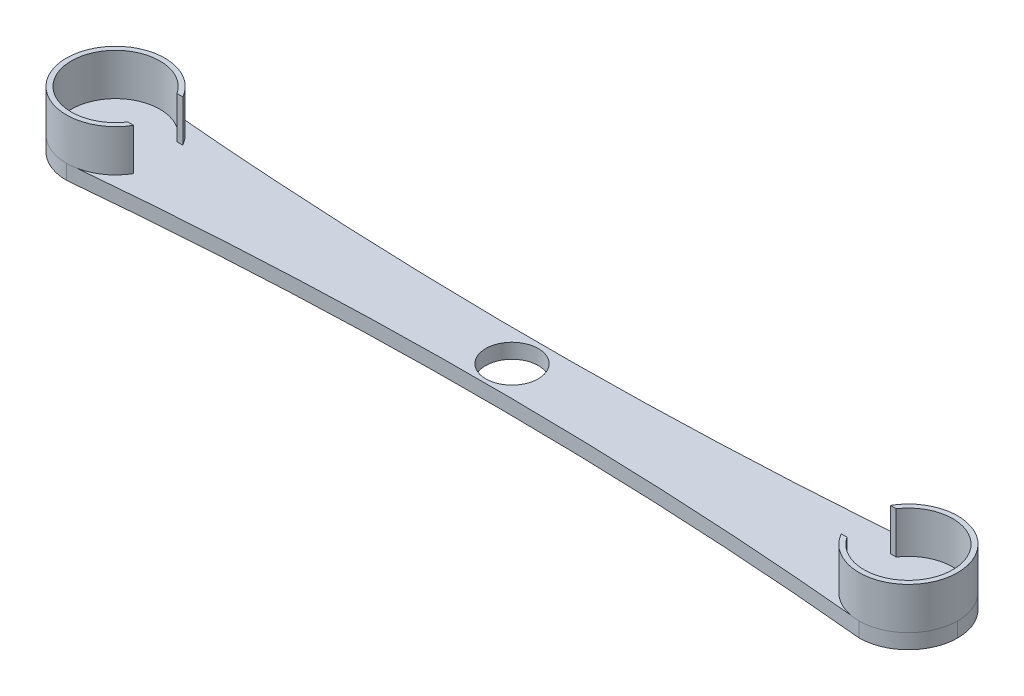
ISO-10303-21;
HEADER;
FILE_DESCRIPTION(('STEP AP214'),'2;1');
FILE_NAME('part.step','',(''),(''),'','','');
FILE_SCHEMA(('AUTOMOTIVE_DESIGN { 1 0 10303 214 1 1 1 1 }'));
ENDSEC;
DATA;
#1=APPLICATION_CONTEXT('core data for automotive mechanical design processes');
#2=APPLICATION_PROTOCOL_DEFINITION('international standard','automotive_design',2000,#1);
#3=PRODUCT_CONTEXT('',#1,'mechanical');
#4=PRODUCT('Part','Part','',(#3));
#5=PRODUCT_RELATED_PRODUCT_CATEGORY('part','',(#4));
#6=PRODUCT_DEFINITION_FORMATION('','',#4);
#7=PRODUCT_DEFINITION_CONTEXT('part definition',#1,'design');
#8=PRODUCT_DEFINITION('design','',#6,#7);
#9=PRODUCT_DEFINITION_SHAPE('','',#8);
#10=(LENGTH_UNIT() NAMED_UNIT(*) SI_UNIT(.MILLI.,.METRE.));
#11=(NAMED_UNIT(*) PLANE_ANGLE_UNIT() SI_UNIT($,.RADIAN.));
#12=(NAMED_UNIT(*) SI_UNIT($,.STERADIAN.) SOLID_ANGLE_UNIT());
#13=UNCERTAINTY_MEASURE_WITH_UNIT(LENGTH_MEASURE(1.E-05),#10,'distance_accuracy_value','');
#14=(GEOMETRIC_REPRESENTATION_CONTEXT(3) GLOBAL_UNCERTAINTY_ASSIGNED_CONTEXT((#13)) GLOBAL_UNIT_ASSIGNED_CONTEXT((#10,
#11,#12)) REPRESENTATION_CONTEXT('',''));
#15=CARTESIAN_POINT('',(0.,0.,0.));
#16=DIRECTION('',(0.,0.,1.));
#17=DIRECTION('',(1.,0.,0.));
#18=AXIS2_PLACEMENT_3D('',#15,#16,#17);
#19=CARTESIAN_POINT('',(0.,3.,-6.375));
#20=DIRECTION('',(0.,-1.,0.));
#21=DIRECTION('',(0.,0.,-1.));
#22=AXIS2_PLACEMENT_3D('',#19,#20,#21);
#23=PLANE('',#22);
#24=CARTESIAN_POINT('',(0.,3.,0.));
#25=DIRECTION('',(0.,1.,0.));
#26=DIRECTION('',(0.,0.,1.));
#27=AXIS2_PLACEMENT_3D('',#24,#25,#26);
#28=CIRCLE('',#27,5.33449361263792);
#29=CARTESIAN_POINT('',(0.,3.,5.33449361263793));
#30=VERTEX_POINT('',#29);
#31=EDGE_CURVE('E228',#30,#30,#28,.T.);
#32=ORIENTED_EDGE('',*,*,#31,.F.);
#33=EDGE_LOOP('',(#32));
#34=FACE_BOUND('',#33,.T.);
#35=CARTESIAN_POINT('',(80.5,3.,0.));
#36=DIRECTION('',(0.,1.,0.));
#37=DIRECTION('',(0.,0.,1.));
#38=AXIS2_PLACEMENT_3D('',#35,#36,#37);
#39=CIRCLE('',#38,10.);
#40=CARTESIAN_POINT('',(71.8397459621556,3.,5.));
#41=VERTEX_POINT('',#40);
#42=CARTESIAN_POINT('',(78.6177020654805,3.,9.82125014882035));
#43=VERTEX_POINT('',#42);
#44=EDGE_CURVE('E394',#41,#43,#39,.T.);
#45=ORIENTED_EDGE('',*,*,#44,.F.);
#46=DIRECTION('',(-1.,0.,0.));
#47=VECTOR('',#46,1.);
#48=CARTESIAN_POINT('',(71.8397459621556,3.,5.));
#49=LINE('',#48,#47);
#50=CARTESIAN_POINT('',(73.0166852264521,3.,5.));
#51=VERTEX_POINT('',#50);
#52=EDGE_CURVE('E400',#51,#41,#49,.T.);
#53=ORIENTED_EDGE('',*,*,#52,.F.);
#54=CARTESIAN_POINT('',(80.5,3.,0.));
#55=DIRECTION('',(0.,-1.,0.));
#56=DIRECTION('',(0.,0.,1.));
#57=AXIS2_PLACEMENT_3D('',#54,#55,#56);
#58=CIRCLE('',#57,9.);
#59=CARTESIAN_POINT('',(73.0166852264521,3.,-5.));
#60=VERTEX_POINT('',#59);
#61=EDGE_CURVE('E188',#60,#51,#58,.T.);
#62=ORIENTED_EDGE('',*,*,#61,.F.);
#63=DIRECTION('',(1.,0.,0.));
#64=VECTOR('',#63,1.);
#65=CARTESIAN_POINT('',(71.8397459621556,3.,-5.));
#66=LINE('',#65,#64);
#67=CARTESIAN_POINT('',(71.8397459621556,3.,-5.));
#68=VERTEX_POINT('',#67);
#69=EDGE_CURVE('E167',#68,#60,#66,.T.);
#70=ORIENTED_EDGE('',*,*,#69,.F.);
#71=CARTESIAN_POINT('',(78.7325547002867,3.,-9.84256760771913));
#72=VERTEX_POINT('',#71);
#73=EDGE_CURVE('E177',#72,#68,#39,.T.);
#74=ORIENTED_EDGE('',*,*,#73,.F.);
#75=CARTESIAN_POINT('',(80.5000000000003,3.,-10.));
#76=CARTESIAN_POINT('',(0.,3.,-2.75));
#77=CARTESIAN_POINT('',(-80.5000000000002,3.,-10.));
#78=B_SPLINE_CURVE_WITH_KNOTS('',2,(#75,#76,#77),.UNSPECIFIED.,.F.,.F.,(3,3),(0.,1.),.UNSPECIFIED.);
#79=CARTESIAN_POINT('',(-78.7325547002872,3.,-9.84256760771916));
#80=VERTEX_POINT('',#79);
#81=EDGE_CURVE('E405',#72,#80,#78,.T.);
#82=ORIENTED_EDGE('',*,*,#81,.T.);
#83=CARTESIAN_POINT('',(-80.5000000000002,3.,0.));
#84=DIRECTION('',(0.,1.,0.));
#85=DIRECTION('',(0.,0.,1.));
#86=AXIS2_PLACEMENT_3D('',#83,#84,#85);
#87=CIRCLE('',#86,10.);
#88=CARTESIAN_POINT('',(-71.8397459621558,3.,-5.));
#89=VERTEX_POINT('',#88);
#90=EDGE_CURVE('E203',#89,#80,#87,.T.);
#91=ORIENTED_EDGE('',*,*,#90,.F.);
#92=DIRECTION('',(1.,0.,0.));
#93=VECTOR('',#92,1.);
#94=CARTESIAN_POINT('',(-73.0166852264523,3.,-5.));
#95=LINE('',#94,#93);
#96=CARTESIAN_POINT('',(-73.0166852264523,3.,-4.99999999999999));
#97=VERTEX_POINT('',#96);
#98=EDGE_CURVE('E196',#97,#89,#95,.T.);
#99=ORIENTED_EDGE('',*,*,#98,.F.);
#100=CARTESIAN_POINT('',(-80.5000000000002,3.,0.));
#101=DIRECTION('',(0.,-1.,0.));
#102=DIRECTION('',(0.,0.,1.));
#103=AXIS2_PLACEMENT_3D('',#100,#101,#102);
#104=CIRCLE('',#103,8.99999999999999);
#105=CARTESIAN_POINT('',(-73.0166852264524,3.,5.));
#106=VERTEX_POINT('',#105);
#107=EDGE_CURVE('E211',#106,#97,#104,.T.);
#108=ORIENTED_EDGE('',*,*,#107,.F.);
#109=DIRECTION('',(-1.,0.,0.));
#110=VECTOR('',#109,1.);
#111=CARTESIAN_POINT('',(-73.0166852264524,3.,5.));
#112=LINE('',#111,#110);
#113=CARTESIAN_POINT('',(-71.8397459621558,3.,5.));
#114=VERTEX_POINT('',#113);
#115=EDGE_CURVE('E206',#114,#106,#112,.T.);
#116=ORIENTED_EDGE('',*,*,#115,.F.);
#117=CARTESIAN_POINT('',(-78.6177020654812,3.,9.82125014882043));
#118=VERTEX_POINT('',#117);
#119=EDGE_CURVE('E208',#118,#114,#87,.T.);
#120=ORIENTED_EDGE('',*,*,#119,.F.);
#121=CARTESIAN_POINT('',(-80.5000000000002,3.,10.));
#122=CARTESIAN_POINT('',(0.,3.,2.26499530901749));
#123=CARTESIAN_POINT('',(80.5000000000003,3.,10.));
#124=B_SPLINE_CURVE_WITH_KNOTS('',2,(#121,#122,#123),.UNSPECIFIED.,.F.,.F.,(3,3),(0.,1.),.UNSPECIFIED.);
#125=EDGE_CURVE('E241',#118,#43,#124,.T.);
#126=ORIENTED_EDGE('',*,*,#125,.T.);
#127=EDGE_LOOP('',(#45,#53,#62,#70,#74,#82,#91,#99,#108,#116,#120,#126));
#128=FACE_BOUND('',#127,.T.);
#129=ADVANCED_FACE('F39',(#34,#128),#23,.F.);
#130=CARTESIAN_POINT('',(0.,0.,-6.375));
#131=DIRECTION('',(0.,-1.,0.));
#132=DIRECTION('',(0.,0.,-1.));
#133=AXIS2_PLACEMENT_3D('',#130,#131,#132);
#134=PLANE('',#133);
#135=CARTESIAN_POINT('',(-80.5000000000002,0.,10.));
#136=CARTESIAN_POINT('',(0.,0.,2.26499530901749));
#137=CARTESIAN_POINT('',(80.5000000000003,0.,10.));
#138=B_SPLINE_CURVE_WITH_KNOTS('',2,(#135,#136,#137),.UNSPECIFIED.,.F.,.F.,(3,3),(0.,1.),.UNSPECIFIED.);
#139=CARTESIAN_POINT('',(-80.5000000000002,0.,10.));
#140=VERTEX_POINT('',#139);
#141=CARTESIAN_POINT('',(80.5000000000003,0.,10.));
#142=VERTEX_POINT('',#141);
#143=EDGE_CURVE('E231',#140,#142,#138,.T.);
#144=ORIENTED_EDGE('',*,*,#143,.F.);
#145=CARTESIAN_POINT('',(-80.5000000000002,0.,0.));
#146=DIRECTION('',(0.,-1.,0.));
#147=DIRECTION('',(0.,0.,-1.));
#148=AXIS2_PLACEMENT_3D('',#145,#146,#147);
#149=CIRCLE('',#148,10.);
#150=CARTESIAN_POINT('',(-90.5000000000002,0.,0.));
#151=VERTEX_POINT('',#150);
#152=EDGE_CURVE('E11',#140,#151,#149,.T.);
#153=ORIENTED_EDGE('',*,*,#152,.T.);
#154=CARTESIAN_POINT('',(-80.5000000000002,0.,0.));
#155=DIRECTION('',(0.,-1.,0.));
#156=DIRECTION('',(0.,0.,-1.));
#157=AXIS2_PLACEMENT_3D('',#154,#155,#156);
#158=CIRCLE('',#157,10.);
#159=CARTESIAN_POINT('',(-80.5000000000002,0.,-10.));
#160=VERTEX_POINT('',#159);
#161=EDGE_CURVE('E48',#151,#160,#158,.T.);
#162=ORIENTED_EDGE('',*,*,#161,.T.);
#163=CARTESIAN_POINT('',(80.5000000000003,0.,-10.));
#164=CARTESIAN_POINT('',(0.,0.,-2.75));
#165=CARTESIAN_POINT('',(-80.5000000000002,0.,-10.));
#166=B_SPLINE_CURVE_WITH_KNOTS('',2,(#163,#164,#165),.UNSPECIFIED.,.F.,.F.,(3,3),(0.,1.),.UNSPECIFIED.);
#167=CARTESIAN_POINT('',(80.5000000000003,0.,-10.));
#168=VERTEX_POINT('',#167);
#169=EDGE_CURVE('E380',#168,#160,#166,.T.);
#170=ORIENTED_EDGE('',*,*,#169,.F.);
#171=CARTESIAN_POINT('',(80.5,0.,0.));
#172=DIRECTION('',(0.,-1.,0.));
#173=DIRECTION('',(0.,0.,-1.));
#174=AXIS2_PLACEMENT_3D('',#171,#172,#173);
#175=CIRCLE('',#174,10.);
#176=CARTESIAN_POINT('',(90.5,0.,0.));
#177=VERTEX_POINT('',#176);
#178=EDGE_CURVE('E61',#168,#177,#175,.T.);
#179=ORIENTED_EDGE('',*,*,#178,.T.);
#180=CARTESIAN_POINT('',(80.5,0.,0.));
#181=DIRECTION('',(0.,-1.,0.));
#182=DIRECTION('',(0.,0.,-1.));
#183=AXIS2_PLACEMENT_3D('',#180,#181,#182);
#184=CIRCLE('',#183,10.);
#185=EDGE_CURVE('E367',#177,#142,#184,.T.);
#186=ORIENTED_EDGE('',*,*,#185,.T.);
#187=EDGE_LOOP('',(#144,#153,#162,#170,#179,#186));
#188=FACE_BOUND('',#187,.T.);
#189=CARTESIAN_POINT('',(0.,0.,0.));
#190=DIRECTION('',(0.,1.,0.));
#191=DIRECTION('',(0.,0.,1.));
#192=AXIS2_PLACEMENT_3D('',#189,#190,#191);
#193=CIRCLE('',#192,5.33449361263792);
#194=CARTESIAN_POINT('',(0.,0.,5.33449361263793));
#195=VERTEX_POINT('',#194);
#196=EDGE_CURVE('E227',#195,#195,#193,.T.);
#197=ORIENTED_EDGE('',*,*,#196,.T.);
#198=EDGE_LOOP('',(#197));
#199=FACE_BOUND('',#198,.T.);
#200=ADVANCED_FACE('F256',(#188,#199),#134,.T.);
#201=DIRECTION('',(0.,-1.,0.));
#202=VECTOR('',#201,1.);
#203=SURFACE_OF_LINEAR_EXTRUSION('',#124,#202);
#204=ORIENTED_EDGE('',*,*,#143,.T.);
#205=DIRECTION('',(0.,-1.,0.));
#206=VECTOR('',#205,1.);
#207=CARTESIAN_POINT('',(80.5000000000003,3.,10.));
#208=LINE('',#207,#206);
#209=CARTESIAN_POINT('',(80.5000000000003,3.,10.));
#210=VERTEX_POINT('',#209);
#211=EDGE_CURVE('E355',#210,#142,#208,.T.);
#212=ORIENTED_EDGE('',*,*,#211,.F.);
#213=CARTESIAN_POINT('',(-80.5000000000002,3.,10.));
#214=CARTESIAN_POINT('',(0.,3.,2.26499530901749));
#215=CARTESIAN_POINT('',(80.5000000000003,3.,10.));
#216=B_SPLINE_CURVE_WITH_KNOTS('',2,(#213,#214,#215),.UNSPECIFIED.,.F.,.F.,(3,3),(0.,1.),.UNSPECIFIED.);
#217=EDGE_CURVE('E182',#43,#210,#216,.T.);
#218=ORIENTED_EDGE('',*,*,#217,.F.);
#219=ORIENTED_EDGE('',*,*,#125,.F.);
#220=CARTESIAN_POINT('',(-80.5000000000002,3.,10.));
#221=VERTEX_POINT('',#220);
#222=EDGE_CURVE('E234',#221,#118,#124,.T.);
#223=ORIENTED_EDGE('',*,*,#222,.F.);
#224=DIRECTION('',(0.,-1.,0.));
#225=VECTOR('',#224,1.);
#226=CARTESIAN_POINT('',(-80.5000000000002,3.,10.));
#227=LINE('',#226,#225);
#228=EDGE_CURVE('E359',#221,#140,#227,.T.);
#229=ORIENTED_EDGE('',*,*,#228,.T.);
#230=EDGE_LOOP('',(#204,#212,#218,#219,#223,#229));
#231=FACE_BOUND('',#230,.T.);
#232=ADVANCED_FACE('F251',(#231),#203,.F.);
#233=DIRECTION('',(0.,-1.,0.));
#234=VECTOR('',#233,1.);
#235=SURFACE_OF_LINEAR_EXTRUSION('',#78,#234);
#236=ORIENTED_EDGE('',*,*,#169,.T.);
#237=DIRECTION('',(0.,-1.,0.));
#238=VECTOR('',#237,1.);
#239=CARTESIAN_POINT('',(-80.5000000000002,3.,-10.));
#240=LINE('',#239,#238);
#241=CARTESIAN_POINT('',(-80.5000000000002,3.,-10.));
#242=VERTEX_POINT('',#241);
#243=EDGE_CURVE('E356',#242,#160,#240,.T.);
#244=ORIENTED_EDGE('',*,*,#243,.F.);
#245=EDGE_CURVE('E240',#80,#242,#78,.T.);
#246=ORIENTED_EDGE('',*,*,#245,.F.);
#247=ORIENTED_EDGE('',*,*,#81,.F.);
#248=CARTESIAN_POINT('',(80.5000000000003,3.,-10.));
#249=VERTEX_POINT('',#248);
#250=EDGE_CURVE('E242',#249,#72,#78,.T.);
#251=ORIENTED_EDGE('',*,*,#250,.F.);
#252=DIRECTION('',(0.,-1.,0.));
#253=VECTOR('',#252,1.);
#254=CARTESIAN_POINT('',(80.5000000000003,3.,-10.));
#255=LINE('',#254,#253);
#256=EDGE_CURVE('E352',#249,#168,#255,.T.);
#257=ORIENTED_EDGE('',*,*,#256,.T.);
#258=EDGE_LOOP('',(#236,#244,#246,#247,#251,#257));
#259=FACE_BOUND('',#258,.T.);
#260=ADVANCED_FACE('F255',(#259),#235,.F.);
#261=CARTESIAN_POINT('',(0.,3.,0.));
#262=DIRECTION('',(0.,-1.,0.));
#263=DIRECTION('',(0.,0.,-1.));
#264=AXIS2_PLACEMENT_3D('',#261,#262,#263);
#265=CYLINDRICAL_SURFACE('',#264,5.33449361263792);
#266=ORIENTED_EDGE('',*,*,#31,.T.);
#267=EDGE_LOOP('',(#266));
#268=FACE_BOUND('',#267,.T.);
#269=ORIENTED_EDGE('',*,*,#196,.F.);
#270=EDGE_LOOP('',(#269));
#271=FACE_BOUND('',#270,.T.);
#272=ADVANCED_FACE('F283',(#268,#271),#265,.F.);
#273=CARTESIAN_POINT('',(-80.5000000000002,3.,0.));
#274=DIRECTION('',(0.,1.,0.));
#275=DIRECTION('',(0.,0.,1.));
#276=AXIS2_PLACEMENT_3D('',#273,#274,#275);
#277=PLANE('',#276);
#278=EDGE_CURVE('E187',#221,#118,#87,.T.);
#279=ORIENTED_EDGE('',*,*,#278,.F.);
#280=ORIENTED_EDGE('',*,*,#222,.T.);
#281=EDGE_LOOP('',(#279,#280));
#282=FACE_BOUND('',#281,.T.);
#283=ADVANCED_FACE('F286',(#282),#277,.F.);
#284=EDGE_CURVE('E207',#80,#242,#87,.T.);
#285=ORIENTED_EDGE('',*,*,#284,.F.);
#286=ORIENTED_EDGE('',*,*,#245,.T.);
#287=EDGE_LOOP('',(#285,#286));
#288=FACE_BOUND('',#287,.T.);
#289=ADVANCED_FACE('F292',(#288),#277,.F.);
#290=CARTESIAN_POINT('',(-80.5000000000002,11.5,0.));
#291=DIRECTION('',(0.,-1.,0.));
#292=DIRECTION('',(0.,0.,-1.));
#293=AXIS2_PLACEMENT_3D('',#290,#291,#292);
#294=CYLINDRICAL_SURFACE('',#293,10.);
#295=ORIENTED_EDGE('',*,*,#90,.T.);
#296=ORIENTED_EDGE('',*,*,#284,.T.);
#297=CARTESIAN_POINT('',(-90.5000000000002,3.,0.));
#298=VERTEX_POINT('',#297);
#299=EDGE_CURVE('E369',#242,#298,#87,.T.);
#300=ORIENTED_EDGE('',*,*,#299,.T.);
#301=EDGE_CURVE('E423',#298,#221,#87,.T.);
#302=ORIENTED_EDGE('',*,*,#301,.T.);
#303=ORIENTED_EDGE('',*,*,#278,.T.);
#304=ORIENTED_EDGE('',*,*,#119,.T.);
#305=DIRECTION('',(0.,-1.,0.));
#306=VECTOR('',#305,1.);
#307=CARTESIAN_POINT('',(-71.8397459621558,11.5,5.));
#308=LINE('',#307,#306);
#309=CARTESIAN_POINT('',(-71.8397459621558,11.5,5.));
#310=VERTEX_POINT('',#309);
#311=EDGE_CURVE('E224',#310,#114,#308,.T.);
#312=ORIENTED_EDGE('',*,*,#311,.F.);
#313=CARTESIAN_POINT('',(-80.5000000000002,11.5,0.));
#314=DIRECTION('',(0.,1.,0.));
#315=DIRECTION('',(0.,0.,1.));
#316=AXIS2_PLACEMENT_3D('',#313,#314,#315);
#317=CIRCLE('',#316,10.);
#318=CARTESIAN_POINT('',(-71.8397459621558,11.5,-5.));
#319=VERTEX_POINT('',#318);
#320=EDGE_CURVE('E189',#319,#310,#317,.T.);
#321=ORIENTED_EDGE('',*,*,#320,.F.);
#322=DIRECTION('',(0.,-1.,0.));
#323=VECTOR('',#322,1.);
#324=CARTESIAN_POINT('',(-71.8397459621558,11.5,-5.));
#325=LINE('',#324,#323);
#326=EDGE_CURVE('E202',#319,#89,#325,.T.);
#327=ORIENTED_EDGE('',*,*,#326,.T.);
#328=EDGE_LOOP('',(#295,#296,#300,#302,#303,#304,#312,#321,#327));
#329=FACE_BOUND('',#328,.T.);
#330=ADVANCED_FACE('F288',(#329),#294,.T.);
#331=CARTESIAN_POINT('',(-73.0166852264524,11.5,5.));
#332=DIRECTION('',(0.,0.,1.));
#333=DIRECTION('',(1.,0.,0.));
#334=AXIS2_PLACEMENT_3D('',#331,#332,#333);
#335=PLANE('',#334);
#336=ORIENTED_EDGE('',*,*,#115,.T.);
#337=DIRECTION('',(0.,-1.,0.));
#338=VECTOR('',#337,1.);
#339=CARTESIAN_POINT('',(-73.0166852264524,11.5,5.));
#340=LINE('',#339,#338);
#341=CARTESIAN_POINT('',(-73.0166852264524,11.5,5.));
#342=VERTEX_POINT('',#341);
#343=EDGE_CURVE('E221',#342,#106,#340,.T.);
#344=ORIENTED_EDGE('',*,*,#343,.F.);
#345=DIRECTION('',(-1.,0.,0.));
#346=VECTOR('',#345,1.);
#347=CARTESIAN_POINT('',(-73.0166852264524,11.5,5.));
#348=LINE('',#347,#346);
#349=EDGE_CURVE('E195',#310,#342,#348,.T.);
#350=ORIENTED_EDGE('',*,*,#349,.F.);
#351=ORIENTED_EDGE('',*,*,#311,.T.);
#352=EDGE_LOOP('',(#336,#344,#350,#351));
#353=FACE_BOUND('',#352,.T.);
#354=ADVANCED_FACE('F291',(#353),#335,.F.);
#355=CARTESIAN_POINT('',(-80.5000000000002,11.5,0.));
#356=DIRECTION('',(0.,-1.,0.));
#357=DIRECTION('',(0.,0.,-1.));
#358=AXIS2_PLACEMENT_3D('',#355,#356,#357);
#359=CYLINDRICAL_SURFACE('',#358,8.99999999999999);
#360=ORIENTED_EDGE('',*,*,#107,.T.);
#361=DIRECTION('',(0.,-1.,0.));
#362=VECTOR('',#361,1.);
#363=CARTESIAN_POINT('',(-73.0166852264523,11.5,-4.99999999999999));
#364=LINE('',#363,#362);
#365=CARTESIAN_POINT('',(-73.0166852264523,11.5,-4.99999999999999));
#366=VERTEX_POINT('',#365);
#367=EDGE_CURVE('E218',#366,#97,#364,.T.);
#368=ORIENTED_EDGE('',*,*,#367,.F.);
#369=CARTESIAN_POINT('',(-80.5000000000002,11.5,0.));
#370=DIRECTION('',(0.,-1.,0.));
#371=DIRECTION('',(0.,0.,1.));
#372=AXIS2_PLACEMENT_3D('',#369,#370,#371);
#373=CIRCLE('',#372,8.99999999999999);
#374=EDGE_CURVE('E198',#342,#366,#373,.T.);
#375=ORIENTED_EDGE('',*,*,#374,.F.);
#376=ORIENTED_EDGE('',*,*,#343,.T.);
#377=EDGE_LOOP('',(#360,#368,#375,#376));
#378=FACE_BOUND('',#377,.T.);
#379=ADVANCED_FACE('F296',(#378),#359,.F.);
#380=CARTESIAN_POINT('',(-73.0166852264523,11.5,-5.));
#381=DIRECTION('',(0.,0.,-1.));
#382=DIRECTION('',(-1.,0.,0.));
#383=AXIS2_PLACEMENT_3D('',#380,#381,#382);
#384=PLANE('',#383);
#385=ORIENTED_EDGE('',*,*,#98,.T.);
#386=ORIENTED_EDGE('',*,*,#326,.F.);
#387=DIRECTION('',(1.,0.,0.));
#388=VECTOR('',#387,1.);
#389=CARTESIAN_POINT('',(-73.0166852264523,11.5,-5.));
#390=LINE('',#389,#388);
#391=EDGE_CURVE('E200',#366,#319,#390,.T.);
#392=ORIENTED_EDGE('',*,*,#391,.F.);
#393=ORIENTED_EDGE('',*,*,#367,.T.);
#394=EDGE_LOOP('',(#385,#386,#392,#393));
#395=FACE_BOUND('',#394,.T.);
#396=ADVANCED_FACE('F300',(#395),#384,.F.);
#397=CARTESIAN_POINT('',(-80.5000000000002,11.5,0.));
#398=DIRECTION('',(0.,1.,0.));
#399=DIRECTION('',(0.,0.,1.));
#400=AXIS2_PLACEMENT_3D('',#397,#398,#399);
#401=PLANE('',#400);
#402=ORIENTED_EDGE('',*,*,#320,.T.);
#403=ORIENTED_EDGE('',*,*,#349,.T.);
#404=ORIENTED_EDGE('',*,*,#374,.T.);
#405=ORIENTED_EDGE('',*,*,#391,.T.);
#406=EDGE_LOOP('',(#402,#403,#404,#405));
#407=FACE_BOUND('',#406,.T.);
#408=ADVANCED_FACE('F304',(#407),#401,.T.);
#409=CARTESIAN_POINT('',(80.5,3.,0.));
#410=DIRECTION('',(0.,1.,0.));
#411=DIRECTION('',(0.,0.,1.));
#412=AXIS2_PLACEMENT_3D('',#409,#410,#411);
#413=PLANE('',#412);
#414=EDGE_CURVE('E397',#43,#210,#39,.T.);
#415=ORIENTED_EDGE('',*,*,#414,.F.);
#416=ORIENTED_EDGE('',*,*,#217,.T.);
#417=EDGE_LOOP('',(#415,#416));
#418=FACE_BOUND('',#417,.T.);
#419=ADVANCED_FACE('F311',(#418),#413,.F.);
#420=EDGE_CURVE('E339',#249,#72,#39,.T.);
#421=ORIENTED_EDGE('',*,*,#420,.F.);
#422=ORIENTED_EDGE('',*,*,#250,.T.);
#423=EDGE_LOOP('',(#421,#422));
#424=FACE_BOUND('',#423,.T.);
#425=ADVANCED_FACE('F317',(#424),#413,.F.);
#426=CARTESIAN_POINT('',(80.5,11.5,0.));
#427=DIRECTION('',(0.,-1.,0.));
#428=DIRECTION('',(0.,0.,-1.));
#429=AXIS2_PLACEMENT_3D('',#426,#427,#428);
#430=CYLINDRICAL_SURFACE('',#429,9.);
#431=ORIENTED_EDGE('',*,*,#61,.T.);
#432=DIRECTION('',(0.,-1.,0.));
#433=VECTOR('',#432,1.);
#434=CARTESIAN_POINT('',(73.0166852264521,11.5,5.));
#435=LINE('',#434,#433);
#436=CARTESIAN_POINT('',(73.0166852264521,11.5,5.));
#437=VERTEX_POINT('',#436);
#438=EDGE_CURVE('E174',#437,#51,#435,.T.);
#439=ORIENTED_EDGE('',*,*,#438,.F.);
#440=CARTESIAN_POINT('',(80.5,11.5,0.));
#441=DIRECTION('',(0.,-1.,0.));
#442=DIRECTION('',(0.,0.,1.));
#443=AXIS2_PLACEMENT_3D('',#440,#441,#442);
#444=CIRCLE('',#443,9.);
#445=CARTESIAN_POINT('',(73.0166852264521,11.5,-5.));
#446=VERTEX_POINT('',#445);
#447=EDGE_CURVE('E155',#446,#437,#444,.T.);
#448=ORIENTED_EDGE('',*,*,#447,.F.);
#449=DIRECTION('',(0.,-1.,0.));
#450=VECTOR('',#449,1.);
#451=CARTESIAN_POINT('',(73.0166852264521,11.5,-5.));
#452=LINE('',#451,#450);
#453=EDGE_CURVE('E162',#446,#60,#452,.T.);
#454=ORIENTED_EDGE('',*,*,#453,.T.);
#455=EDGE_LOOP('',(#431,#439,#448,#454));
#456=FACE_BOUND('',#455,.T.);
#457=ADVANCED_FACE('F172',(#456),#430,.F.);
#458=CARTESIAN_POINT('',(71.8397459621556,11.5,5.));
#459=DIRECTION('',(0.,0.,1.));
#460=DIRECTION('',(1.,0.,0.));
#461=AXIS2_PLACEMENT_3D('',#458,#459,#460);
#462=PLANE('',#461);
#463=ORIENTED_EDGE('',*,*,#52,.T.);
#464=DIRECTION('',(0.,-1.,0.));
#465=VECTOR('',#464,1.);
#466=CARTESIAN_POINT('',(71.8397459621556,11.5,5.));
#467=LINE('',#466,#465);
#468=CARTESIAN_POINT('',(71.8397459621556,11.5,5.));
#469=VERTEX_POINT('',#468);
#470=EDGE_CURVE('E375',#469,#41,#467,.T.);
#471=ORIENTED_EDGE('',*,*,#470,.F.);
#472=DIRECTION('',(-1.,0.,0.));
#473=VECTOR('',#472,1.);
#474=CARTESIAN_POINT('',(71.8397459621556,11.5,5.));
#475=LINE('',#474,#473);
#476=EDGE_CURVE('E175',#437,#469,#475,.T.);
#477=ORIENTED_EDGE('',*,*,#476,.F.);
#478=ORIENTED_EDGE('',*,*,#438,.T.);
#479=EDGE_LOOP('',(#463,#471,#477,#478));
#480=FACE_BOUND('',#479,.T.);
#481=ADVANCED_FACE('F324',(#480),#462,.F.);
#482=CARTESIAN_POINT('',(80.5,11.5,0.));
#483=DIRECTION('',(0.,-1.,0.));
#484=DIRECTION('',(0.,0.,-1.));
#485=AXIS2_PLACEMENT_3D('',#482,#483,#484);
#486=CYLINDRICAL_SURFACE('',#485,10.);
#487=ORIENTED_EDGE('',*,*,#44,.T.);
#488=ORIENTED_EDGE('',*,*,#414,.T.);
#489=CARTESIAN_POINT('',(90.5,3.,0.));
#490=VERTEX_POINT('',#489);
#491=EDGE_CURVE('E348',#210,#490,#39,.T.);
#492=ORIENTED_EDGE('',*,*,#491,.T.);
#493=EDGE_CURVE('E342',#490,#249,#39,.T.);
#494=ORIENTED_EDGE('',*,*,#493,.T.);
#495=ORIENTED_EDGE('',*,*,#420,.T.);
#496=ORIENTED_EDGE('',*,*,#73,.T.);
#497=DIRECTION('',(0.,-1.,0.));
#498=VECTOR('',#497,1.);
#499=CARTESIAN_POINT('',(71.8397459621556,11.5,-5.));
#500=LINE('',#499,#498);
#501=CARTESIAN_POINT('',(71.8397459621556,11.5,-5.));
#502=VERTEX_POINT('',#501);
#503=EDGE_CURVE('E170',#502,#68,#500,.T.);
#504=ORIENTED_EDGE('',*,*,#503,.F.);
#505=CARTESIAN_POINT('',(80.5,11.5,0.));
#506=DIRECTION('',(0.,1.,0.));
#507=DIRECTION('',(0.,0.,1.));
#508=AXIS2_PLACEMENT_3D('',#505,#506,#507);
#509=CIRCLE('',#508,10.);
#510=EDGE_CURVE('E158',#469,#502,#509,.T.);
#511=ORIENTED_EDGE('',*,*,#510,.F.);
#512=ORIENTED_EDGE('',*,*,#470,.T.);
#513=EDGE_LOOP('',(#487,#488,#492,#494,#495,#496,#504,#511,#512));
#514=FACE_BOUND('',#513,.T.);
#515=ADVANCED_FACE('F321',(#514),#486,.T.);
#516=CARTESIAN_POINT('',(71.8397459621556,11.5,-5.));
#517=DIRECTION('',(0.,0.,-1.));
#518=DIRECTION('',(-1.,0.,0.));
#519=AXIS2_PLACEMENT_3D('',#516,#517,#518);
#520=PLANE('',#519);
#521=ORIENTED_EDGE('',*,*,#69,.T.);
#522=ORIENTED_EDGE('',*,*,#453,.F.);
#523=DIRECTION('',(1.,0.,0.));
#524=VECTOR('',#523,1.);
#525=CARTESIAN_POINT('',(71.8397459621556,11.5,-5.));
#526=LINE('',#525,#524);
#527=EDGE_CURVE('E151',#502,#446,#526,.T.);
#528=ORIENTED_EDGE('',*,*,#527,.F.);
#529=ORIENTED_EDGE('',*,*,#503,.T.);
#530=EDGE_LOOP('',(#521,#522,#528,#529));
#531=FACE_BOUND('',#530,.T.);
#532=ADVANCED_FACE('F166',(#531),#520,.F.);
#533=CARTESIAN_POINT('',(80.5,11.5,0.));
#534=DIRECTION('',(0.,1.,0.));
#535=DIRECTION('',(0.,0.,1.));
#536=AXIS2_PLACEMENT_3D('',#533,#534,#535);
#537=PLANE('',#536);
#538=ORIENTED_EDGE('',*,*,#447,.T.);
#539=ORIENTED_EDGE('',*,*,#476,.T.);
#540=ORIENTED_EDGE('',*,*,#510,.T.);
#541=ORIENTED_EDGE('',*,*,#527,.T.);
#542=EDGE_LOOP('',(#538,#539,#540,#541));
#543=FACE_BOUND('',#542,.T.);
#544=ADVANCED_FACE('F153',(#543),#537,.T.);
#545=CARTESIAN_POINT('',(-80.5000000000002,3.,0.));
#546=DIRECTION('',(0.,-1.,0.));
#547=DIRECTION('',(0.,0.,-1.));
#548=AXIS2_PLACEMENT_3D('',#545,#546,#547);
#549=CYLINDRICAL_SURFACE('',#548,10.);
#550=DIRECTION('',(0.,-1.,0.));
#551=VECTOR('',#550,1.);
#552=CARTESIAN_POINT('',(-90.5000000000002,3.,0.));
#553=LINE('',#552,#551);
#554=EDGE_CURVE('E371',#298,#151,#553,.T.);
#555=ORIENTED_EDGE('',*,*,#554,.F.);
#556=ORIENTED_EDGE('',*,*,#299,.F.);
#557=ORIENTED_EDGE('',*,*,#243,.T.);
#558=ORIENTED_EDGE('',*,*,#161,.F.);
#559=EDGE_LOOP('',(#555,#556,#557,#558));
#560=FACE_BOUND('',#559,.T.);
#561=ADVANCED_FACE('F262',(#560),#549,.T.);
#562=CARTESIAN_POINT('',(-80.5000000000002,3.,0.));
#563=DIRECTION('',(0.,-1.,0.));
#564=DIRECTION('',(0.,0.,-1.));
#565=AXIS2_PLACEMENT_3D('',#562,#563,#564);
#566=CYLINDRICAL_SURFACE('',#565,10.);
#567=ORIENTED_EDGE('',*,*,#301,.F.);
#568=ORIENTED_EDGE('',*,*,#554,.T.);
#569=ORIENTED_EDGE('',*,*,#152,.F.);
#570=ORIENTED_EDGE('',*,*,#228,.F.);
#571=EDGE_LOOP('',(#567,#568,#569,#570));
#572=FACE_BOUND('',#571,.T.);
#573=ADVANCED_FACE('F259',(#572),#566,.T.);
#574=CARTESIAN_POINT('',(80.5,3.,0.));
#575=DIRECTION('',(0.,-1.,0.));
#576=DIRECTION('',(0.,0.,-1.));
#577=AXIS2_PLACEMENT_3D('',#574,#575,#576);
#578=CYLINDRICAL_SURFACE('',#577,10.);
#579=DIRECTION('',(0.,-1.,0.));
#580=VECTOR('',#579,1.);
#581=CARTESIAN_POINT('',(90.5,3.,0.));
#582=LINE('',#581,#580);
#583=EDGE_CURVE('E43',#490,#177,#582,.T.);
#584=ORIENTED_EDGE('',*,*,#583,.F.);
#585=ORIENTED_EDGE('',*,*,#491,.F.);
#586=ORIENTED_EDGE('',*,*,#211,.T.);
#587=ORIENTED_EDGE('',*,*,#185,.F.);
#588=EDGE_LOOP('',(#584,#585,#586,#587));
#589=FACE_BOUND('',#588,.T.);
#590=ADVANCED_FACE('F41',(#589),#578,.T.);
#591=CARTESIAN_POINT('',(80.5,3.,0.));
#592=DIRECTION('',(0.,-1.,0.));
#593=DIRECTION('',(0.,0.,-1.));
#594=AXIS2_PLACEMENT_3D('',#591,#592,#593);
#595=CYLINDRICAL_SURFACE('',#594,10.);
#596=ORIENTED_EDGE('',*,*,#493,.F.);
#597=ORIENTED_EDGE('',*,*,#583,.T.);
#598=ORIENTED_EDGE('',*,*,#178,.F.);
#599=ORIENTED_EDGE('',*,*,#256,.F.);
#600=EDGE_LOOP('',(#596,#597,#598,#599));
#601=FACE_BOUND('',#600,.T.);
#602=ADVANCED_FACE('F266',(#601),#595,.T.);
#603=CLOSED_SHELL('',(#129,#200,#232,#260,#272,#283,#289,#330,#354,#379,#396,#408,#419,#425,
#457,#481,#515,#532,#544,#561,#573,#590,#602));
#604=MANIFOLD_SOLID_BREP('B2',#603);
#605=ADVANCED_BREP_SHAPE_REPRESENTATION('',(#18,#604),#14);
#606=SHAPE_DEFINITION_REPRESENTATION(#9,#605);
ENDSEC;
END-ISO-10303-21;
